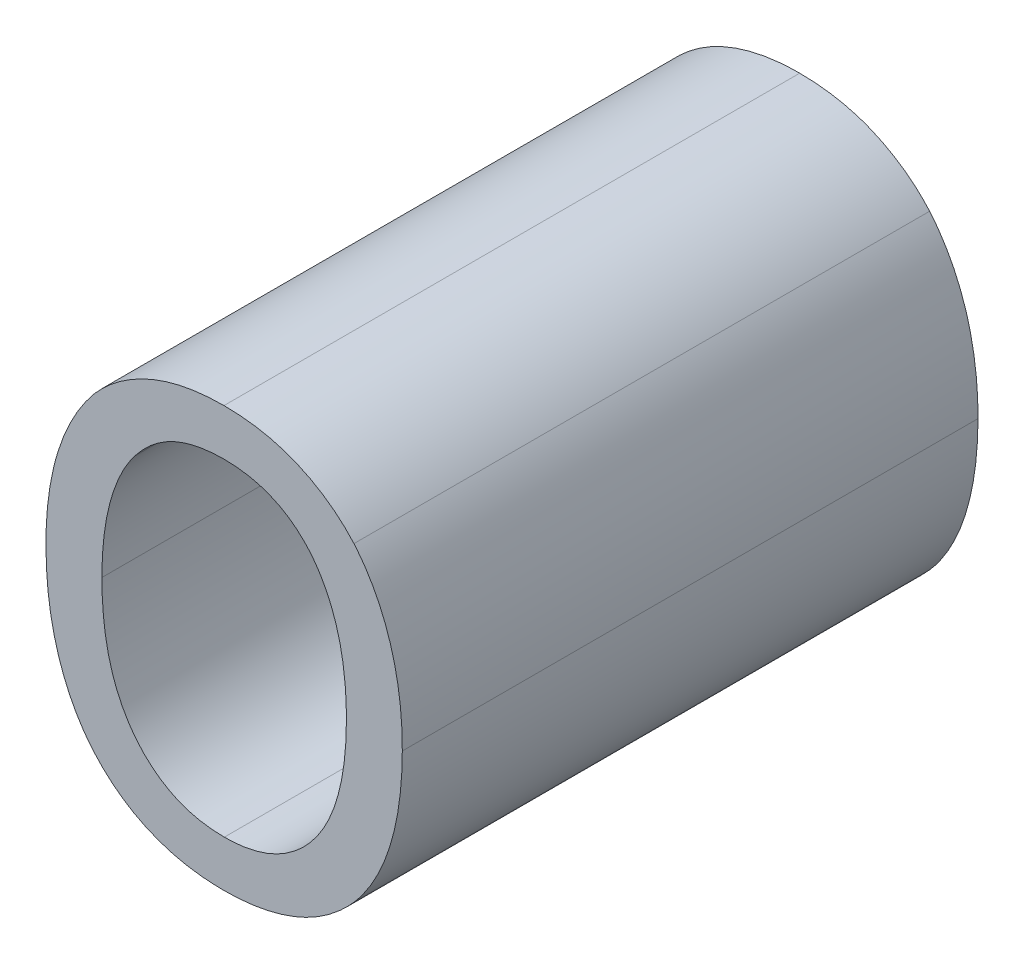
ISO-10303-21;
HEADER;
FILE_DESCRIPTION(('STEP AP214'),'2;1');
FILE_NAME('part.step','',(''),(''),'','','');
FILE_SCHEMA(('AUTOMOTIVE_DESIGN { 1 0 10303 214 1 1 1 1 }'));
ENDSEC;
DATA;
#1=APPLICATION_CONTEXT('core data for automotive mechanical design processes');
#2=APPLICATION_PROTOCOL_DEFINITION('international standard','automotive_design',2000,#1);
#3=PRODUCT_CONTEXT('',#1,'mechanical');
#4=PRODUCT('Part','Part','',(#3));
#5=PRODUCT_RELATED_PRODUCT_CATEGORY('part','',(#4));
#6=PRODUCT_DEFINITION_FORMATION('','',#4);
#7=PRODUCT_DEFINITION_CONTEXT('part definition',#1,'design');
#8=PRODUCT_DEFINITION('design','',#6,#7);
#9=PRODUCT_DEFINITION_SHAPE('','',#8);
#10=(LENGTH_UNIT() NAMED_UNIT(*) SI_UNIT(.MILLI.,.METRE.));
#11=(NAMED_UNIT(*) PLANE_ANGLE_UNIT() SI_UNIT($,.RADIAN.));
#12=(NAMED_UNIT(*) SI_UNIT($,.STERADIAN.) SOLID_ANGLE_UNIT());
#13=UNCERTAINTY_MEASURE_WITH_UNIT(LENGTH_MEASURE(1.E-05),#10,'distance_accuracy_value','');
#14=(GEOMETRIC_REPRESENTATION_CONTEXT(3) GLOBAL_UNCERTAINTY_ASSIGNED_CONTEXT((#13)) GLOBAL_UNIT_ASSIGNED_CONTEXT((#10,
#11,#12)) REPRESENTATION_CONTEXT('',''));
#15=CARTESIAN_POINT('',(0.,0.,0.));
#16=DIRECTION('',(0.,0.,1.));
#17=DIRECTION('',(1.,0.,0.));
#18=AXIS2_PLACEMENT_3D('',#15,#16,#17);
#19=CARTESIAN_POINT('',(0.422403275104176,-0.565334370552193,0.));
#20=CARTESIAN_POINT('',(0.422403275104176,-0.565334370552193,0.1));
#21=CARTESIAN_POINT('',(0.432103437478142,-0.565334370552193,0.));
#22=CARTESIAN_POINT('',(0.432103437478142,-0.565334370552193,0.1));
#23=CARTESIAN_POINT('',(0.443618834916242,-0.550699037847612,0.));
#24=CARTESIAN_POINT('',(0.443618834916242,-0.550699037847612,0.1));
#25=CARTESIAN_POINT('',(0.443618834916242,-0.536914596579344,0.));
#26=CARTESIAN_POINT('',(0.443618834916242,-0.536914596579344,0.1));
#27=B_SPLINE_SURFACE_WITH_KNOTS('',2,1,((#19,#20),(#21,#22),(#23,#24),(#25,#26)),.UNSPECIFIED.,
.F.,.F.,.F.,(3,1,3),(2,2),(0.,0.5,1.),(0.,1.),.UNSPECIFIED.);
#28=CARTESIAN_POINT('',(0.422403275104176,-0.565334370552193,0.));
#29=CARTESIAN_POINT('',(0.423495138457044,-0.565334263107982,0.));
#30=CARTESIAN_POINT('',(0.424590715243333,-0.565264151797034,0.));
#31=CARTESIAN_POINT('',(0.426759658611366,-0.564957067043967,0.));
#32=CARTESIAN_POINT('',(0.427832976390072,-0.564719760156023,0.));
#33=CARTESIAN_POINT('',(0.430637326541838,-0.563822783819439,0.));
#34=CARTESIAN_POINT('',(0.432316583185164,-0.562985304936494,0.));
#35=CARTESIAN_POINT('',(0.43537698398701,-0.560810381148516,0.));
#36=CARTESIAN_POINT('',(0.436747967024062,-0.559459023493926,0.));
#37=CARTESIAN_POINT('',(0.439229436705532,-0.556245914148621,0.));
#38=CARTESIAN_POINT('',(0.440281450420306,-0.5543402874569,0.));
#39=CARTESIAN_POINT('',(0.442097683101466,-0.549858351756391,0.));
#40=CARTESIAN_POINT('',(0.442726866479257,-0.547232566941976,0.));
#41=CARTESIAN_POINT('',(0.443467601855112,-0.542023477904733,0.));
#42=CARTESIAN_POINT('',(0.443601358169113,-0.539443657523063,0.));
#43=CARTESIAN_POINT('',(0.443618834916242,-0.536914596432091,0.));
#44=B_SPLINE_CURVE_WITH_KNOTS('',3,(#28,#29,#30,#31,#32,#33,#34,#35,#36,#37,#38,#39,#40,#41,#42,
#43),.UNSPECIFIED.,.F.,.F.,(4,2,2,2,2,2,2,4),(0.,0.00327846290659307,0.00656348277852888,
0.0120934053194897,0.0177851425822794,0.0242300112273422,0.0322649099058238,0.0399350119896171),.UNSPECIFIED.);
#45=CARTESIAN_POINT('',(0.422403275104176,-0.565334370552193,0.));
#46=VERTEX_POINT('',#45);
#47=CARTESIAN_POINT('',(0.443618834916242,-0.536914596579344,0.));
#48=VERTEX_POINT('',#47);
#49=EDGE_CURVE('E11',#46,#48,#44,.T.);
#50=DIRECTION('',(0.,0.,1.));
#51=VECTOR('',#50,1.);
#52=CARTESIAN_POINT('',(0.422403275104176,-0.565334370552193,0.));
#53=LINE('',#52,#51);
#54=CARTESIAN_POINT('',(0.422403275104176,-0.565334370552193,0.1));
#55=VERTEX_POINT('',#54);
#56=EDGE_CURVE('E319',#46,#55,#53,.T.);
#57=CARTESIAN_POINT('',(0.443618834916242,-0.536914596579344,0.1));
#58=CARTESIAN_POINT('',(0.443612031296942,-0.54079173974196,0.1));
#59=CARTESIAN_POINT('',(0.443279629406607,-0.544918162100005,0.1));
#60=CARTESIAN_POINT('',(0.441567296807279,-0.551406113980255,0.1));
#61=CARTESIAN_POINT('',(0.440578244383015,-0.553893690361702,0.1));
#62=CARTESIAN_POINT('',(0.438075855391576,-0.557905684085802,0.1));
#63=CARTESIAN_POINT('',(0.4367232359663,-0.559521923418348,0.1));
#64=CARTESIAN_POINT('',(0.433726522308547,-0.562091791110961,0.1));
#65=CARTESIAN_POINT('',(0.432127181825424,-0.563096741479701,0.1));
#66=CARTESIAN_POINT('',(0.428677919089497,-0.564551973429292,0.1));
#67=CARTESIAN_POINT('',(0.426825613979062,-0.564996510459382,0.1));
#68=CARTESIAN_POINT('',(0.424104545069922,-0.56529326478391,0.1));
#69=CARTESIAN_POINT('',(0.423251272825868,-0.56533639619699,0.1));
#70=CARTESIAN_POINT('',(0.422403272522582,-0.565334370552193,0.1));
#71=B_SPLINE_CURVE_WITH_KNOTS('',3,(#57,#58,#59,#60,#61,#62,#63,#64,#65,#66,#67,#68,#69,#70),
.UNSPECIFIED.,.F.,.F.,(4,2,2,2,2,2,4),(0.,0.0119835687455253,0.0199276332555216,
0.0261447212240271,0.0317172910651487,0.0373465303396994,0.0399005627300019),.UNSPECIFIED.);
#72=CARTESIAN_POINT('',(0.443618834916242,-0.536914596579344,0.1));
#73=VERTEX_POINT('',#72);
#74=EDGE_CURVE('E325',#73,#55,#71,.T.);
#75=DIRECTION('',(0.,0.,1.));
#76=VECTOR('',#75,1.);
#77=CARTESIAN_POINT('',(0.443618834916242,-0.536914596579344,0.));
#78=LINE('',#77,#76);
#79=EDGE_CURVE('E340',#48,#73,#78,.T.);
#80=ORIENTED_EDGE('',*,*,#49,.F.);
#81=ORIENTED_EDGE('',*,*,#56,.T.);
#82=ORIENTED_EDGE('',*,*,#74,.F.);
#83=ORIENTED_EDGE('',*,*,#79,.F.);
#84=EDGE_LOOP('',(#80,#81,#82,#83));
#85=FACE_BOUND('',#84,.T.);
#86=ADVANCED_FACE('F17',(#85),#27,.F.);
#87=CARTESIAN_POINT('',(0.401130989196355,-0.536914596579344,0.));
#88=CARTESIAN_POINT('',(0.401130989196355,-0.536914596579344,0.1));
#89=CARTESIAN_POINT('',(0.401130989196355,-0.550699037847612,0.));
#90=CARTESIAN_POINT('',(0.401130989196355,-0.550699037847612,0.1));
#91=CARTESIAN_POINT('',(0.412703112730209,-0.565334370552193,0.));
#92=CARTESIAN_POINT('',(0.412703112730209,-0.565334370552193,0.1));
#93=CARTESIAN_POINT('',(0.422403275104176,-0.565334370552193,0.));
#94=CARTESIAN_POINT('',(0.422403275104176,-0.565334370552193,0.1));
#95=B_SPLINE_SURFACE_WITH_KNOTS('',2,1,((#87,#88),(#89,#90),(#91,#92),(#93,#94)),.UNSPECIFIED.,
.F.,.F.,.F.,(3,1,3),(2,2),(0.,0.5,1.),(0.,1.),.UNSPECIFIED.);
#96=CARTESIAN_POINT('',(0.401130989196355,-0.536914596579344,0.));
#97=CARTESIAN_POINT('',(0.401136241934104,-0.540785127218079,0.));
#98=CARTESIAN_POINT('',(0.401470524293703,-0.544903733464903,0.));
#99=CARTESIAN_POINT('',(0.403184922398802,-0.551383233523398,0.));
#100=CARTESIAN_POINT('',(0.404175927829298,-0.553869767470615,0.));
#101=CARTESIAN_POINT('',(0.406683302419975,-0.557882444810912,0.));
#102=CARTESIAN_POINT('',(0.408040140921679,-0.55950004273732,0.));
#103=CARTESIAN_POINT('',(0.411048222164214,-0.562078897590311,0.));
#104=CARTESIAN_POINT('',(0.412656260396007,-0.563089727471742,0.));
#105=CARTESIAN_POINT('',(0.416121817826099,-0.564551333481528,0.));
#106=CARTESIAN_POINT('',(0.417981310997891,-0.564997355105394,0.));
#107=CARTESIAN_POINT('',(0.420707036765639,-0.565293517204085,0.));
#108=CARTESIAN_POINT('',(0.421557758650891,-0.565336401203627,0.));
#109=CARTESIAN_POINT('',(0.42240327765669,-0.565334370552193,0.));
#110=B_SPLINE_CURVE_WITH_KNOTS('',3,(#96,#97,#98,#99,#100,#101,#102,#103,#104,#105,#106,#107,
#108,#109),.UNSPECIFIED.,.F.,.F.,(4,2,2,2,2,2,4),(0.,0.0119617055059878,0.0199045495341607,
0.0261332744891407,0.031736974221413,0.0373875384496303,0.0399340164870983),.UNSPECIFIED.);
#111=CARTESIAN_POINT('',(0.401130989196355,-0.536914596579344,0.));
#112=VERTEX_POINT('',#111);
#113=EDGE_CURVE('E32',#112,#46,#110,.T.);
#114=DIRECTION('',(0.,0.,1.));
#115=VECTOR('',#114,1.);
#116=CARTESIAN_POINT('',(0.401130989196355,-0.536914596579344,0.));
#117=LINE('',#116,#115);
#118=CARTESIAN_POINT('',(0.401130989196355,-0.536914596579344,0.1));
#119=VERTEX_POINT('',#118);
#120=EDGE_CURVE('E322',#112,#119,#117,.T.);
#121=CARTESIAN_POINT('',(0.422403275104176,-0.565334370552193,0.1));
#122=CARTESIAN_POINT('',(0.421309075220846,-0.565334280650465,0.1));
#123=CARTESIAN_POINT('',(0.420211154492617,-0.565263846528418,0.1));
#124=CARTESIAN_POINT('',(0.418037826487701,-0.564955665739269,0.1));
#125=CARTESIAN_POINT('',(0.416962463534833,-0.56471761660866,0.1));
#126=CARTESIAN_POINT('',(0.414149121808028,-0.563817179758932,0.1));
#127=CARTESIAN_POINT('',(0.412463435151057,-0.562975626676238,0.1));
#128=CARTESIAN_POINT('',(0.409387351404414,-0.560789951499222,0.1));
#129=CARTESIAN_POINT('',(0.408007798204483,-0.559430979759868,0.1));
#130=CARTESIAN_POINT('',(0.405516949016988,-0.556205329726687,0.1));
#131=CARTESIAN_POINT('',(0.404462527146574,-0.554295947226072,0.1));
#132=CARTESIAN_POINT('',(0.402644185222629,-0.549806229594325,0.1));
#133=CARTESIAN_POINT('',(0.402015454601813,-0.547176360654875,0.1));
#134=CARTESIAN_POINT('',(0.401280621076095,-0.541983177571889,0.1));
#135=CARTESIAN_POINT('',(0.40114803606537,-0.539423983049477,0.1));
#136=CARTESIAN_POINT('',(0.401130989196355,-0.536914596131235,0.1));
#137=B_SPLINE_CURVE_WITH_KNOTS('',3,(#121,#122,#123,#124,#125,#126,#127,#128,#129,#130,#131,
#132,#133,#134,#135,#136),.UNSPECIFIED.,.F.,.F.,(4,2,2,2,2,2,2,4),(0.,0.00328547995459584,
0.00657690384601922,0.0121294196598876,0.0178550344786013,0.024312925223907,0.0323587914208523,
0.0399685244388434),.UNSPECIFIED.);
#138=EDGE_CURVE('E336',#55,#119,#137,.T.);
#139=ORIENTED_EDGE('',*,*,#113,.F.);
#140=ORIENTED_EDGE('',*,*,#120,.T.);
#141=ORIENTED_EDGE('',*,*,#138,.F.);
#142=ORIENTED_EDGE('',*,*,#56,.F.);
#143=EDGE_LOOP('',(#139,#140,#141,#142));
#144=FACE_BOUND('',#143,.T.);
#145=ADVANCED_FACE('F209',(#144),#95,.F.);
#146=CARTESIAN_POINT('',(0.406860324867528,-0.515755762863032,0.));
#147=CARTESIAN_POINT('',(0.406860324867528,-0.515755762863032,0.1));
#148=CARTESIAN_POINT('',(0.404080746175573,-0.519329506895546,0.));
#149=CARTESIAN_POINT('',(0.404080746175573,-0.519329506895546,0.1));
#150=CARTESIAN_POINT('',(0.401130989196355,-0.530107465088842,0.));
#151=CARTESIAN_POINT('',(0.401130989196355,-0.530107465088842,0.1));
#152=CARTESIAN_POINT('',(0.401130989196355,-0.536914596579344,0.));
#153=CARTESIAN_POINT('',(0.401130989196355,-0.536914596579344,0.1));
#154=B_SPLINE_SURFACE_WITH_KNOTS('',2,1,((#146,#147),(#148,#149),(#150,#151),(#152,#153)),
.UNSPECIFIED.,.F.,.F.,.F.,(3,1,3),(2,2),(0.,0.5,1.),(0.,1.),.UNSPECIFIED.);
#155=CARTESIAN_POINT('',(0.406860324867528,-0.515755762863032,0.));
#156=CARTESIAN_POINT('',(0.405657397335435,-0.517343188494508,0.));
#157=CARTESIAN_POINT('',(0.40469318068862,-0.519060110368438,0.));
#158=CARTESIAN_POINT('',(0.402837976651734,-0.523410798796499,0.));
#159=CARTESIAN_POINT('',(0.402142700160432,-0.526129789551262,0.));
#160=CARTESIAN_POINT('',(0.401306736121386,-0.531562905988082,0.));
#161=CARTESIAN_POINT('',(0.401147723861368,-0.534273956397874,0.));
#162=CARTESIAN_POINT('',(0.401130989196355,-0.536914599776286,0.));
#163=B_SPLINE_CURVE_WITH_KNOTS('',3,(#155,#156,#157,#158,#159,#160,#161,#162),.UNSPECIFIED.,.F.,
.F.,(4,2,2,4),(0.,0.00589018398543234,0.014219790021341,0.0222617131194405),.UNSPECIFIED.);
#164=CARTESIAN_POINT('',(0.406860324867528,-0.515755762863032,0.));
#165=VERTEX_POINT('',#164);
#166=EDGE_CURVE('E308',#165,#112,#163,.T.);
#167=DIRECTION('',(0.,0.,1.));
#168=VECTOR('',#167,1.);
#169=CARTESIAN_POINT('',(0.406860324867528,-0.515755762863032,0.));
#170=LINE('',#169,#168);
#171=CARTESIAN_POINT('',(0.406860324867528,-0.515755762863032,0.1));
#172=VERTEX_POINT('',#171);
#173=EDGE_CURVE('E334',#165,#172,#170,.T.);
#174=CARTESIAN_POINT('',(0.401130989196355,-0.536914596579344,0.1));
#175=CARTESIAN_POINT('',(0.401133799328813,-0.534884316236864,0.1));
#176=CARTESIAN_POINT('',(0.40122926046152,-0.532850992452005,0.1));
#177=CARTESIAN_POINT('',(0.401688291751139,-0.528772010387163,0.1));
#178=CARTESIAN_POINT('',(0.402057633057826,-0.526727041384421,0.1));
#179=CARTESIAN_POINT('',(0.403288166939586,-0.522218760920778,0.1));
#180=CARTESIAN_POINT('',(0.404247549902667,-0.519775436044707,0.1));
#181=CARTESIAN_POINT('',(0.405987204330638,-0.516948613481366,0.1));
#182=CARTESIAN_POINT('',(0.406406313305087,-0.516339946628976,0.1));
#183=CARTESIAN_POINT('',(0.406860324867528,-0.515755762863032,0.1));
#184=B_SPLINE_CURVE_WITH_KNOTS('',3,(#174,#175,#176,#177,#178,#179,#180,#181,#182,#183),
.UNSPECIFIED.,.F.,.F.,(4,2,2,2,4),(0.,0.00608990690111218,0.0123119217698571,0.0200554605451938,
0.0222703824689008),.UNSPECIFIED.);
#185=EDGE_CURVE('E352',#119,#172,#184,.T.);
#186=ORIENTED_EDGE('',*,*,#166,.F.);
#187=ORIENTED_EDGE('',*,*,#173,.T.);
#188=ORIENTED_EDGE('',*,*,#185,.F.);
#189=ORIENTED_EDGE('',*,*,#120,.F.);
#190=EDGE_LOOP('',(#186,#187,#188,#189));
#191=FACE_BOUND('',#190,.T.);
#192=ADVANCED_FACE('F205',(#191),#154,.F.);
#193=CARTESIAN_POINT('',(0.422403275104176,-0.508494822606496,0.));
#194=CARTESIAN_POINT('',(0.422403275104176,-0.508494822606496,0.1));
#195=CARTESIAN_POINT('',(0.417354652582053,-0.508494822606496,0.));
#196=CARTESIAN_POINT('',(0.417354652582053,-0.508494822606496,0.1));
#197=CARTESIAN_POINT('',(0.409753355750992,-0.512011840543256,0.));
#198=CARTESIAN_POINT('',(0.409753355750992,-0.512011840543256,0.1));
#199=CARTESIAN_POINT('',(0.406860324867528,-0.515755762863032,0.));
#200=CARTESIAN_POINT('',(0.406860324867528,-0.515755762863032,0.1));
#201=B_SPLINE_SURFACE_WITH_KNOTS('',2,1,((#193,#194),(#195,#196),(#197,#198),(#199,#200)),
.UNSPECIFIED.,.F.,.F.,.F.,(3,1,3),(2,2),(0.,0.5,1.),(0.,1.),.UNSPECIFIED.);
#202=CARTESIAN_POINT('',(0.422403275104176,-0.508494822606496,0.));
#203=CARTESIAN_POINT('',(0.421300453813318,-0.508494125766198,0.));
#204=CARTESIAN_POINT('',(0.420191502778547,-0.508557579077204,0.));
#205=CARTESIAN_POINT('',(0.417993518156848,-0.508844335852738,0.));
#206=CARTESIAN_POINT('',(0.416904519609753,-0.509067897179064,0.));
#207=CARTESIAN_POINT('',(0.415032527364356,-0.509631339319363,0.));
#208=CARTESIAN_POINT('',(0.414237914597769,-0.509931375759785,0.));
#209=CARTESIAN_POINT('',(0.41270672773958,-0.51065143038063,0.));
#210=CARTESIAN_POINT('',(0.411970028668521,-0.51107118061213,0.));
#211=CARTESIAN_POINT('',(0.410427823343848,-0.512113748382064,0.));
#212=CARTESIAN_POINT('',(0.40963867187544,-0.512760485981555,0.));
#213=CARTESIAN_POINT('',(0.408166099117643,-0.514176197228732,0.));
#214=CARTESIAN_POINT('',(0.407483538723554,-0.514946073733799,0.));
#215=CARTESIAN_POINT('',(0.406860324215222,-0.515755763707193,0.));
#216=B_SPLINE_CURVE_WITH_KNOTS('',3,(#202,#203,#204,#205,#206,#207,#208,#209,#210,#211,#212,
#213,#214,#215),.UNSPECIFIED.,.F.,.F.,(4,2,2,2,2,2,4),(0.,0.00331628387168298,
0.00663792082681027,0.00917652757676522,0.0117094963019628,0.0147562616431061,
0.0178264866671859),.UNSPECIFIED.);
#217=CARTESIAN_POINT('',(0.422403275104176,-0.508494822606496,0.));
#218=VERTEX_POINT('',#217);
#219=EDGE_CURVE('E300',#218,#165,#216,.T.);
#220=DIRECTION('',(0.,0.,1.));
#221=VECTOR('',#220,1.);
#222=CARTESIAN_POINT('',(0.422403275104176,-0.508494822606496,0.));
#223=LINE('',#222,#221);
#224=CARTESIAN_POINT('',(0.422403275104176,-0.508494822606496,0.1));
#225=VERTEX_POINT('',#224);
#226=EDGE_CURVE('E350',#218,#225,#223,.T.);
#227=CARTESIAN_POINT('',(0.406860324867528,-0.515755762863032,0.1));
#228=CARTESIAN_POINT('',(0.407459671786939,-0.514977469977176,0.1));
#229=CARTESIAN_POINT('',(0.408113359846047,-0.514236081261466,0.1));
#230=CARTESIAN_POINT('',(0.409520624565216,-0.512866050952403,0.1));
#231=CARTESIAN_POINT('',(0.410273513565939,-0.512236697598913,0.1));
#232=CARTESIAN_POINT('',(0.411762219669041,-0.511199459827289,0.1));
#233=CARTESIAN_POINT('',(0.412484723938984,-0.510772702581416,0.1));
#234=CARTESIAN_POINT('',(0.413988608098148,-0.510036085517271,0.1));
#235=CARTESIAN_POINT('',(0.414770108727842,-0.509726473677614,0.1));
#236=CARTESIAN_POINT('',(0.416669798307297,-0.509121991480205,0.1));
#237=CARTESIAN_POINT('',(0.417803432495361,-0.508877087486116,0.1));
#238=CARTESIAN_POINT('',(0.420094967342109,-0.508563096043584,0.1));
#239=CARTESIAN_POINT('',(0.421252849390878,-0.508493878408972,0.1));
#240=CARTESIAN_POINT('',(0.422403278342035,-0.508494822606496,0.1));
#241=B_SPLINE_CURVE_WITH_KNOTS('',3,(#227,#228,#229,#230,#231,#232,#233,#234,#235,#236,#237,
#238,#239,#240),.UNSPECIFIED.,.F.,.F.,(4,2,2,2,2,2,4),(0.,0.0029509931779533,
0.00588251197857523,0.00838956159719114,0.0109018889472316,0.0143654450247536,
0.0178264338061303),.UNSPECIFIED.);
#242=EDGE_CURVE('E363',#172,#225,#241,.T.);
#243=ORIENTED_EDGE('',*,*,#219,.F.);
#244=ORIENTED_EDGE('',*,*,#226,.T.);
#245=ORIENTED_EDGE('',*,*,#242,.F.);
#246=ORIENTED_EDGE('',*,*,#173,.F.);
#247=EDGE_LOOP('',(#243,#244,#245,#246));
#248=FACE_BOUND('',#247,.T.);
#249=ADVANCED_FACE('F370',(#248),#201,.F.);
#250=CARTESIAN_POINT('',(0.437889499245069,-0.515755762863032,0.));
#251=CARTESIAN_POINT('',(0.437889499245069,-0.515755762863032,0.1));
#252=CARTESIAN_POINT('',(0.435109920553114,-0.512125292734764,0.));
#253=CARTESIAN_POINT('',(0.435109920553114,-0.512125292734764,0.1));
#254=CARTESIAN_POINT('',(0.427281719339036,-0.508494822606496,0.));
#255=CARTESIAN_POINT('',(0.427281719339036,-0.508494822606496,0.1));
#256=CARTESIAN_POINT('',(0.422403275104176,-0.508494822606496,0.));
#257=CARTESIAN_POINT('',(0.422403275104176,-0.508494822606496,0.1));
#258=B_SPLINE_SURFACE_WITH_KNOTS('',2,1,((#250,#251),(#252,#253),(#254,#255),(#256,#257)),
.UNSPECIFIED.,.F.,.F.,.F.,(3,1,3),(2,2),(0.,0.5,1.),(0.,1.),.UNSPECIFIED.);
#259=CARTESIAN_POINT('',(0.437889499245069,-0.515755762863032,0.));
#260=CARTESIAN_POINT('',(0.437309438402187,-0.514996323780321,0.));
#261=CARTESIAN_POINT('',(0.436674437035518,-0.514277273284337,0.));
#262=CARTESIAN_POINT('',(0.435305465842282,-0.512950390543772,0.));
#263=CARTESIAN_POINT('',(0.434572137557362,-0.512341893009954,0.));
#264=CARTESIAN_POINT('',(0.432352197083969,-0.510799342294575,0.));
#265=CARTESIAN_POINT('',(0.43075133372932,-0.51002273452031,0.));
#266=CARTESIAN_POINT('',(0.428004313107924,-0.509137128183772,0.));
#267=CARTESIAN_POINT('',(0.42689776427983,-0.50888912418037,0.));
#268=CARTESIAN_POINT('',(0.424661024830168,-0.508567753400762,0.));
#269=CARTESIAN_POINT('',(0.423530884027806,-0.508494050070703,0.));
#270=CARTESIAN_POINT('',(0.42240327458025,-0.508494822606496,0.));
#271=B_SPLINE_CURVE_WITH_KNOTS('',3,(#259,#260,#261,#262,#263,#264,#265,#266,#267,#268,#269,
#270),.UNSPECIFIED.,.F.,.F.,(4,2,2,2,2,4),(0.,0.00286586350035589,0.00571386404001678,
0.01096053436187,0.0143501879972104,0.0177332912518968),.UNSPECIFIED.);
#272=CARTESIAN_POINT('',(0.437889499245069,-0.515755762863032,0.));
#273=VERTEX_POINT('',#272);
#274=EDGE_CURVE('E291',#273,#218,#271,.T.);
#275=DIRECTION('',(0.,0.,1.));
#276=VECTOR('',#275,1.);
#277=CARTESIAN_POINT('',(0.437889499245069,-0.515755762863032,0.));
#278=LINE('',#277,#276);
#279=CARTESIAN_POINT('',(0.437889499245069,-0.515755762863032,0.1));
#280=VERTEX_POINT('',#279);
#281=EDGE_CURVE('E362',#273,#280,#278,.T.);
#282=CARTESIAN_POINT('',(0.422403275104176,-0.508494822606496,0.1));
#283=CARTESIAN_POINT('',(0.423506929251667,-0.508494371114695,0.1));
#284=CARTESIAN_POINT('',(0.424612619654994,-0.508564769394667,0.1));
#285=CARTESIAN_POINT('',(0.426802676934392,-0.508871736015724,0.1));
#286=CARTESIAN_POINT('',(0.427886986270143,-0.509108702728819,0.1));
#287=CARTESIAN_POINT('',(0.430671777095638,-0.509983496206457,0.1));
#288=CARTESIAN_POINT('',(0.43232879584073,-0.510779987335825,0.1));
#289=CARTESIAN_POINT('',(0.434589267004601,-0.512355495324966,0.1));
#290=CARTESIAN_POINT('',(0.435318569042352,-0.512962071332491,0.1));
#291=CARTESIAN_POINT('',(0.436680239427701,-0.514283939737924,0.1));
#292=CARTESIAN_POINT('',(0.437311986428375,-0.514999875523894,0.1));
#293=CARTESIAN_POINT('',(0.437889499278994,-0.515755762907342,0.1));
#294=B_SPLINE_CURVE_WITH_KNOTS('',3,(#282,#283,#284,#285,#286,#287,#288,#289,#290,#291,#292,
#293),.UNSPECIFIED.,.F.,.F.,(4,2,2,2,2,4),(0.,0.00331059657843944,0.00662913797694552,
0.012044048621758,0.0148793222088958,0.017731969019986),.UNSPECIFIED.);
#295=EDGE_CURVE('E639',#225,#280,#294,.T.);
#296=ORIENTED_EDGE('',*,*,#274,.F.);
#297=ORIENTED_EDGE('',*,*,#281,.T.);
#298=ORIENTED_EDGE('',*,*,#295,.F.);
#299=ORIENTED_EDGE('',*,*,#226,.F.);
#300=EDGE_LOOP('',(#296,#297,#298,#299));
#301=FACE_BOUND('',#300,.T.);
#302=ADVANCED_FACE('F375',(#301),#258,.F.);
#303=CARTESIAN_POINT('',(0.443618834916242,-0.536914596579344,0.));
#304=CARTESIAN_POINT('',(0.443618834916242,-0.536914596579344,0.1));
#305=CARTESIAN_POINT('',(0.443618834916242,-0.529994012897334,0.));
#306=CARTESIAN_POINT('',(0.443618834916242,-0.529994012897334,0.1));
#307=CARTESIAN_POINT('',(0.44061235184127,-0.519272780799792,0.));
#308=CARTESIAN_POINT('',(0.44061235184127,-0.519272780799792,0.1));
#309=CARTESIAN_POINT('',(0.437889499245069,-0.515755762863032,0.));
#310=CARTESIAN_POINT('',(0.437889499245069,-0.515755762863032,0.1));
#311=B_SPLINE_SURFACE_WITH_KNOTS('',2,1,((#303,#304),(#305,#306),(#307,#308),(#309,#310)),
.UNSPECIFIED.,.F.,.F.,.F.,(3,1,3),(2,2),(0.,0.5,1.),(0.,1.),.UNSPECIFIED.);
#312=CARTESIAN_POINT('',(0.443618834916242,-0.536914596579344,0.));
#313=CARTESIAN_POINT('',(0.443619302461356,-0.534925601213001,0.));
#314=CARTESIAN_POINT('',(0.443527832583521,-0.532934234743709,0.));
#315=CARTESIAN_POINT('',(0.443086995570201,-0.528941711974556,0.));
#316=CARTESIAN_POINT('',(0.442732526090879,-0.526941151211069,0.));
#317=CARTESIAN_POINT('',(0.441538996925787,-0.522455036419514,0.));
#318=CARTESIAN_POINT('',(0.440591830136626,-0.519991001133212,0.));
#319=CARTESIAN_POINT('',(0.438839233059685,-0.517069647790521,0.));
#320=CARTESIAN_POINT('',(0.438384958208045,-0.51639844312515,0.));
#321=CARTESIAN_POINT('',(0.437889499245069,-0.515755762863032,0.));
#322=B_SPLINE_CURVE_WITH_KNOTS('',3,(#312,#313,#314,#315,#316,#317,#318,#319,#320,#321),
.UNSPECIFIED.,.F.,.F.,(4,2,2,2,4),(0.,0.00596495310252562,0.0120487591867507,0.0198405488048869,
0.0222693443160283),.UNSPECIFIED.);
#323=EDGE_CURVE('E281',#48,#273,#322,.T.);
#324=CARTESIAN_POINT('',(0.437889499910816,-0.515755763722956,0.1));
#325=CARTESIAN_POINT('',(0.439061870241123,-0.51731655358336,0.1));
#326=CARTESIAN_POINT('',(0.440010103698864,-0.519000477638522,0.1));
#327=CARTESIAN_POINT('',(0.44183523303496,-0.523230889879549,0.1));
#328=CARTESIAN_POINT('',(0.44253550077574,-0.525855070217112,0.1));
#329=CARTESIAN_POINT('',(0.443434165475869,-0.531313209850699,0.1));
#330=CARTESIAN_POINT('',(0.443609834776302,-0.53415134152759,0.1));
#331=CARTESIAN_POINT('',(0.443618834916242,-0.536914596579344,0.1));
#332=B_SPLINE_CURVE_WITH_KNOTS('',3,(#324,#325,#326,#327,#328,#329,#330,#331),.UNSPECIFIED.,.F.,
.F.,(4,2,2,4),(0.,0.00578056075423867,0.0138479751007666,0.0222601694424388),.UNSPECIFIED.);
#333=EDGE_CURVE('E631',#280,#73,#332,.T.);
#334=ORIENTED_EDGE('',*,*,#323,.F.);
#335=ORIENTED_EDGE('',*,*,#79,.T.);
#336=ORIENTED_EDGE('',*,*,#333,.F.);
#337=ORIENTED_EDGE('',*,*,#281,.F.);
#338=EDGE_LOOP('',(#334,#335,#336,#337));
#339=FACE_BOUND('',#338,.T.);
#340=ADVANCED_FACE('F387',(#339),#311,.F.);
#341=CARTESIAN_POINT('',(0.444923535118588,-0.563859492062584,0.));
#342=CARTESIAN_POINT('',(0.444923535118588,-0.563859492062584,0.1));
#343=CARTESIAN_POINT('',(0.44900781401289,-0.55920795221074,0.));
#344=CARTESIAN_POINT('',(0.44900781401289,-0.55920795221074,0.1));
#345=CARTESIAN_POINT('',(0.453318997290208,-0.545423510942473,0.));
#346=CARTESIAN_POINT('',(0.453318997290208,-0.545423510942473,0.1));
#347=CARTESIAN_POINT('',(0.453318997290208,-0.536914596579344,0.));
#348=CARTESIAN_POINT('',(0.453318997290208,-0.536914596579344,0.1));
#349=B_SPLINE_SURFACE_WITH_KNOTS('',2,1,((#341,#342),(#343,#344),(#345,#346),(#347,#348)),
.UNSPECIFIED.,.F.,.F.,.F.,(3,1,3),(2,2),(0.,0.5,1.),(0.,1.),.UNSPECIFIED.);
#350=CARTESIAN_POINT('',(0.453318997290208,-0.536914596579344,0.));
#351=CARTESIAN_POINT('',(0.453319377126097,-0.541759116328101,0.));
#352=CARTESIAN_POINT('',(0.452766654998256,-0.54689435369178,0.));
#353=CARTESIAN_POINT('',(0.450382857559368,-0.554984717923288,0.));
#354=CARTESIAN_POINT('',(0.449026036563842,-0.558105682325099,0.));
#355=CARTESIAN_POINT('',(0.446493366795907,-0.561936645027127,0.));
#356=CARTESIAN_POINT('',(0.445744416851001,-0.5629244590235,0.));
#357=CARTESIAN_POINT('',(0.444923535118588,-0.563859492062584,0.));
#358=B_SPLINE_CURVE_WITH_KNOTS('',3,(#350,#351,#352,#353,#354,#355,#356,#357),.UNSPECIFIED.,.F.,
.F.,(4,2,2,4),(0.,0.0149417427834172,0.0250236945272247,0.0287382814460734),.UNSPECIFIED.);
#359=CARTESIAN_POINT('',(0.453318997290208,-0.536914596579344,0.));
#360=VERTEX_POINT('',#359);
#361=CARTESIAN_POINT('',(0.444923535118588,-0.563859492062584,0.));
#362=VERTEX_POINT('',#361);
#363=EDGE_CURVE('E272',#360,#362,#358,.T.);
#364=DIRECTION('',(0.,0.,1.));
#365=VECTOR('',#364,1.);
#366=CARTESIAN_POINT('',(0.453318997290208,-0.536914596579344,0.));
#367=LINE('',#366,#365);
#368=CARTESIAN_POINT('',(0.453318997290208,-0.536914596579344,0.1));
#369=VERTEX_POINT('',#368);
#370=EDGE_CURVE('E633',#360,#369,#367,.T.);
#371=CARTESIAN_POINT('',(0.444923535118588,-0.563859492062584,0.1));
#372=CARTESIAN_POINT('',(0.446733519556315,-0.561773134216273,0.1));
#373=CARTESIAN_POINT('',(0.448191069417562,-0.559463949940256,0.1));
#374=CARTESIAN_POINT('',(0.450876486294953,-0.553782620340378,0.1));
#375=CARTESIAN_POINT('',(0.451886761792927,-0.550304981888601,0.1));
#376=CARTESIAN_POINT('',(0.453075952558193,-0.543489544655986,0.1));
#377=CARTESIAN_POINT('',(0.453314628920135,-0.540162640926936,0.1));
#378=CARTESIAN_POINT('',(0.453318997290208,-0.536914596579344,0.1));
#379=B_SPLINE_CURVE_WITH_KNOTS('',3,(#371,#372,#373,#374,#375,#376,#377,#378),.UNSPECIFIED.,.F.,
.F.,(4,2,2,4),(0.,0.0081554324233815,0.0188841996620323,0.0287591796295877),.UNSPECIFIED.);
#380=CARTESIAN_POINT('',(0.444923535118588,-0.563859492062584,0.1));
#381=VERTEX_POINT('',#380);
#382=EDGE_CURVE('E148',#381,#369,#379,.T.);
#383=DIRECTION('',(0.,0.,1.));
#384=VECTOR('',#383,1.);
#385=CARTESIAN_POINT('',(0.444923535118588,-0.563859492062584,0.));
#386=LINE('',#385,#384);
#387=EDGE_CURVE('E628',#362,#381,#386,.T.);
#388=ORIENTED_EDGE('',*,*,#363,.F.);
#389=ORIENTED_EDGE('',*,*,#370,.T.);
#390=ORIENTED_EDGE('',*,*,#382,.F.);
#391=ORIENTED_EDGE('',*,*,#387,.F.);
#392=EDGE_LOOP('',(#388,#389,#390,#391));
#393=FACE_BOUND('',#392,.T.);
#394=ADVANCED_FACE('F425',(#393),#349,.T.);
#395=CARTESIAN_POINT('',(0.422346549008422,-0.573389476149288,0.));
#396=CARTESIAN_POINT('',(0.422346549008422,-0.573389476149288,0.1));
#397=CARTESIAN_POINT('',(0.429210406594678,-0.573389476149288,0.));
#398=CARTESIAN_POINT('',(0.429210406594678,-0.573389476149288,0.1));
#399=CARTESIAN_POINT('',(0.44061235184127,-0.568737936297444,0.));
#400=CARTESIAN_POINT('',(0.44061235184127,-0.568737936297444,0.1));
#401=CARTESIAN_POINT('',(0.444923535118588,-0.563859492062584,0.));
#402=CARTESIAN_POINT('',(0.444923535118588,-0.563859492062584,0.1));
#403=B_SPLINE_SURFACE_WITH_KNOTS('',2,1,((#395,#396),(#397,#398),(#399,#400),(#401,#402)),
.UNSPECIFIED.,.F.,.F.,.F.,(3,1,3),(2,2),(0.,0.5,1.),(0.,1.),.UNSPECIFIED.);
#404=CARTESIAN_POINT('',(0.444923535118588,-0.563859492062584,0.));
#405=CARTESIAN_POINT('',(0.443979647850496,-0.564930703959633,0.));
#406=CARTESIAN_POINT('',(0.442955532951998,-0.565936857241807,0.));
#407=CARTESIAN_POINT('',(0.440773028247587,-0.567771198652658,0.));
#408=CARTESIAN_POINT('',(0.43961574850832,-0.568600714143578,0.));
#409=CARTESIAN_POINT('',(0.436133970793655,-0.570673245856667,0.));
#410=CARTESIAN_POINT('',(0.433658581672484,-0.571662072570593,0.));
#411=CARTESIAN_POINT('',(0.428231934333968,-0.573068915307128,0.));
#412=CARTESIAN_POINT('',(0.42525879731928,-0.573407304802974,0.));
#413=CARTESIAN_POINT('',(0.422346547180717,-0.573389476149288,0.));
#414=B_SPLINE_CURVE_WITH_KNOTS('',3,(#404,#405,#406,#407,#408,#409,#410,#411,#412,#413),
.UNSPECIFIED.,.F.,.F.,(4,2,2,2,4),(0.,0.0042864880371566,0.00853952962219771,0.016434569833852,
0.0252464885748008),.UNSPECIFIED.);
#415=CARTESIAN_POINT('',(0.422346549008422,-0.573389476149288,0.));
#416=VERTEX_POINT('',#415);
#417=EDGE_CURVE('E263',#362,#416,#414,.T.);
#418=CARTESIAN_POINT('',(0.422346549008422,-0.573389476149288,0.1));
#419=CARTESIAN_POINT('',(0.424074645698756,-0.573394117914761,0.1));
#420=CARTESIAN_POINT('',(0.425808362723922,-0.573280082106338,0.1));
#421=CARTESIAN_POINT('',(0.429245133822292,-0.572790439937054,0.1));
#422=CARTESIAN_POINT('',(0.430948028397471,-0.572413736237487,0.1));
#423=CARTESIAN_POINT('',(0.433917270564457,-0.571483347283172,0.1));
#424=CARTESIAN_POINT('',(0.43520015344063,-0.570983491187605,0.1));
#425=CARTESIAN_POINT('',(0.437666882087705,-0.569787009801194,0.1));
#426=CARTESIAN_POINT('',(0.438851041564834,-0.569091041179727,0.1));
#427=CARTESIAN_POINT('',(0.440882226039323,-0.567671274593099,0.1));
#428=CARTESIAN_POINT('',(0.441750673036085,-0.566977589316842,0.1));
#429=CARTESIAN_POINT('',(0.443403162110922,-0.565489424967366,0.1));
#430=CARTESIAN_POINT('',(0.444186845051399,-0.564694545881521,0.1));
#431=CARTESIAN_POINT('',(0.444923535836414,-0.563859491250307,0.1));
#432=B_SPLINE_CURVE_WITH_KNOTS('',3,(#418,#419,#420,#421,#422,#423,#424,#425,#426,#427,#428,
#429,#430,#431),.UNSPECIFIED.,.F.,.F.,(4,2,2,2,2,2,4),(0.,0.00518866537633728,
0.0103991381585853,0.0145146283545649,0.0186164986050824,0.0219432246937128,0.025283535060455),.UNSPECIFIED.);
#433=CARTESIAN_POINT('',(0.422346549008422,-0.573389476149288,0.1));
#434=VERTEX_POINT('',#433);
#435=EDGE_CURVE('E596',#434,#381,#432,.T.);
#436=DIRECTION('',(0.,0.,1.));
#437=VECTOR('',#436,1.);
#438=CARTESIAN_POINT('',(0.422346549008422,-0.573389476149288,0.));
#439=LINE('',#438,#437);
#440=EDGE_CURVE('E597',#416,#434,#439,.T.);
#441=ORIENTED_EDGE('',*,*,#417,.F.);
#442=ORIENTED_EDGE('',*,*,#387,.T.);
#443=ORIENTED_EDGE('',*,*,#435,.F.);
#444=ORIENTED_EDGE('',*,*,#440,.F.);
#445=EDGE_LOOP('',(#441,#442,#443,#444));
#446=FACE_BOUND('',#445,.T.);
#447=ADVANCED_FACE('F434',(#446),#403,.T.);
#448=CARTESIAN_POINT('',(0.399769562898255,-0.563859492062584,0.));
#449=CARTESIAN_POINT('',(0.399769562898255,-0.563859492062584,0.1));
#450=CARTESIAN_POINT('',(0.40391056788831,-0.568567758010182,0.));
#451=CARTESIAN_POINT('',(0.40391056788831,-0.568567758010182,0.1));
#452=CARTESIAN_POINT('',(0.415255787039148,-0.573389476149288,0.));
#453=CARTESIAN_POINT('',(0.415255787039148,-0.573389476149288,0.1));
#454=CARTESIAN_POINT('',(0.422346549008422,-0.573389476149288,0.));
#455=CARTESIAN_POINT('',(0.422346549008422,-0.573389476149288,0.1));
#456=B_SPLINE_SURFACE_WITH_KNOTS('',2,1,((#448,#449),(#450,#451),(#452,#453),(#454,#455)),
.UNSPECIFIED.,.F.,.F.,.F.,(3,1,3),(2,2),(0.,0.5,1.),(0.,1.),.UNSPECIFIED.);
#457=CARTESIAN_POINT('',(0.422346549008422,-0.573389476149288,0.));
#458=CARTESIAN_POINT('',(0.4206488106466,-0.573388542772347,0.));
#459=CARTESIAN_POINT('',(0.418944682095406,-0.57328464626476,0.));
#460=CARTESIAN_POINT('',(0.415566545979323,-0.572823870443045,0.));
#461=CARTESIAN_POINT('',(0.413892657164917,-0.572466152582958,0.));
#462=CARTESIAN_POINT('',(0.409609435250187,-0.571132305215097,0.));
#463=CARTESIAN_POINT('',(0.407069841235336,-0.569909323790423,0.));
#464=CARTESIAN_POINT('',(0.402923503534712,-0.56706418566721,0.));
#465=CARTESIAN_POINT('',(0.40123129266969,-0.565564163660016,0.));
#466=CARTESIAN_POINT('',(0.39976956262314,-0.563859491749782,0.));
#467=B_SPLINE_CURVE_WITH_KNOTS('',3,(#457,#458,#459,#460,#461,#462,#463,#464,#465,#466),
.UNSPECIFIED.,.F.,.F.,(4,2,2,2,4),(0.,0.00509914188389758,0.0102152086387487,0.0185311546522564,
0.0252465262798625),.UNSPECIFIED.);
#468=CARTESIAN_POINT('',(0.399769562898255,-0.563859492062584,0.));
#469=VERTEX_POINT('',#468);
#470=EDGE_CURVE('E254',#416,#469,#467,.T.);
#471=CARTESIAN_POINT('',(0.399769562898255,-0.563859492062584,0.1));
#472=CARTESIAN_POINT('',(0.400702057302251,-0.564923461045821,0.1));
#473=CARTESIAN_POINT('',(0.401714606335394,-0.565916494707897,0.1));
#474=CARTESIAN_POINT('',(0.403874049205539,-0.56772811709826,0.1));
#475=CARTESIAN_POINT('',(0.405020050425695,-0.568547772079635,0.1));
#476=CARTESIAN_POINT('',(0.408588067191142,-0.570686688472177,0.1));
#477=CARTESIAN_POINT('',(0.411181241003681,-0.571732899737961,0.1));
#478=CARTESIAN_POINT('',(0.415243694963202,-0.572750924582415,0.1));
#479=CARTESIAN_POINT('',(0.416655804875346,-0.572997359072509,0.1));
#480=CARTESIAN_POINT('',(0.419494526207104,-0.573315664376537,0.1));
#481=CARTESIAN_POINT('',(0.420921057458925,-0.573388226609436,0.1));
#482=CARTESIAN_POINT('',(0.422346551968604,-0.573389476149288,0.1));
#483=B_SPLINE_CURVE_WITH_KNOTS('',3,(#471,#472,#473,#474,#475,#476,#477,#478,#479,#480,#481,
#482),.UNSPECIFIED.,.F.,.F.,(4,2,2,2,2,4),(0.,0.00423855354869852,0.00845022975004553,
0.0166944225333528,0.0209864077122709,0.0252612968859685),.UNSPECIFIED.);
#484=CARTESIAN_POINT('',(0.399769562898255,-0.563859492062584,0.1));
#485=VERTEX_POINT('',#484);
#486=EDGE_CURVE('E591',#485,#434,#483,.T.);
#487=DIRECTION('',(0.,0.,1.));
#488=VECTOR('',#487,1.);
#489=CARTESIAN_POINT('',(0.399769562898255,-0.563859492062584,0.));
#490=LINE('',#489,#488);
#491=EDGE_CURVE('E583',#469,#485,#490,.T.);
#492=ORIENTED_EDGE('',*,*,#470,.F.);
#493=ORIENTED_EDGE('',*,*,#440,.T.);
#494=ORIENTED_EDGE('',*,*,#486,.F.);
#495=ORIENTED_EDGE('',*,*,#491,.F.);
#496=EDGE_LOOP('',(#492,#493,#494,#495));
#497=FACE_BOUND('',#496,.T.);
#498=ADVANCED_FACE('F176',(#497),#456,.T.);
#499=CARTESIAN_POINT('',(0.391430826822389,-0.536914596579344,0.));
#500=CARTESIAN_POINT('',(0.391430826822389,-0.536914596579344,0.1));
#501=CARTESIAN_POINT('',(0.391430826822389,-0.545536963133981,0.));
#502=CARTESIAN_POINT('',(0.391430826822389,-0.545536963133981,0.1));
#503=CARTESIAN_POINT('',(0.395742010099707,-0.55920795221074,0.));
#504=CARTESIAN_POINT('',(0.395742010099707,-0.55920795221074,0.1));
#505=CARTESIAN_POINT('',(0.399769562898255,-0.563859492062584,0.));
#506=CARTESIAN_POINT('',(0.399769562898255,-0.563859492062584,0.1));
#507=B_SPLINE_SURFACE_WITH_KNOTS('',2,1,((#499,#500),(#501,#502),(#503,#504),(#505,#506)),
.UNSPECIFIED.,.F.,.F.,.F.,(3,1,3),(2,2),(0.,0.5,1.),(0.,1.),.UNSPECIFIED.);
#508=CARTESIAN_POINT('',(0.399769560710295,-0.563859489535643,0.));
#509=CARTESIAN_POINT('',(0.397945523307779,-0.561727344370371,0.));
#510=CARTESIAN_POINT('',(0.396478627091824,-0.559370498479029,0.));
#511=CARTESIAN_POINT('',(0.393823455459418,-0.553662362924461,0.));
#512=CARTESIAN_POINT('',(0.392830165602586,-0.550217993676251,0.));
#513=CARTESIAN_POINT('',(0.391659147428498,-0.543456013236409,0.));
#514=CARTESIAN_POINT('',(0.39142541688837,-0.540148518440552,0.));
#515=CARTESIAN_POINT('',(0.391430826822389,-0.536914593058157,0.));
#516=B_SPLINE_CURVE_WITH_KNOTS('',3,(#508,#509,#510,#511,#512,#513,#514,#515),.UNSPECIFIED.,.F.,
.F.,(4,2,2,4),(0.,0.00828925386879238,0.0189142857720691,0.028735701489796),.UNSPECIFIED.);
#517=CARTESIAN_POINT('',(0.391430826822389,-0.536914596579344,0.));
#518=VERTEX_POINT('',#517);
#519=EDGE_CURVE('E245',#469,#518,#516,.T.);
#520=CARTESIAN_POINT('',(0.391430826822389,-0.536914596579344,0.1));
#521=CARTESIAN_POINT('',(0.391410155669695,-0.541683396815348,0.1));
#522=CARTESIAN_POINT('',(0.391944593406085,-0.546712100861349,0.1));
#523=CARTESIAN_POINT('',(0.394262543061807,-0.554768839901038,0.1));
#524=CARTESIAN_POINT('',(0.395618160628635,-0.557941158398271,0.1));
#525=CARTESIAN_POINT('',(0.398165714808172,-0.561864226832996,0.1));
#526=CARTESIAN_POINT('',(0.398930229819545,-0.562889084533737,0.1));
#527=CARTESIAN_POINT('',(0.399769562898255,-0.563859492062584,0.1));
#528=B_SPLINE_CURVE_WITH_KNOTS('',3,(#520,#521,#522,#523,#524,#525,#526,#527),.UNSPECIFIED.,.F.,
.F.,(4,2,2,4),(0.,0.0146667499266819,0.0248861304010869,0.028717169316052),.UNSPECIFIED.);
#529=CARTESIAN_POINT('',(0.391430826822389,-0.536914596579344,0.1));
#530=VERTEX_POINT('',#529);
#531=EDGE_CURVE('E581',#530,#485,#528,.T.);
#532=DIRECTION('',(0.,0.,1.));
#533=VECTOR('',#532,1.);
#534=CARTESIAN_POINT('',(0.391430826822389,-0.536914596579344,0.));
#535=LINE('',#534,#533);
#536=EDGE_CURVE('E578',#518,#530,#535,.T.);
#537=ORIENTED_EDGE('',*,*,#519,.F.);
#538=ORIENTED_EDGE('',*,*,#491,.T.);
#539=ORIENTED_EDGE('',*,*,#531,.F.);
#540=ORIENTED_EDGE('',*,*,#536,.F.);
#541=EDGE_LOOP('',(#537,#538,#539,#540));
#542=FACE_BOUND('',#541,.T.);
#543=ADVANCED_FACE('F171',(#542),#507,.T.);
#544=CARTESIAN_POINT('',(0.399826288994009,-0.509912975000351,0.));
#545=CARTESIAN_POINT('',(0.399826288994009,-0.509912975000351,0.1));
#546=CARTESIAN_POINT('',(0.395798736195461,-0.514734693139457,0.));
#547=CARTESIAN_POINT('',(0.395798736195461,-0.514734693139457,0.1));
#548=CARTESIAN_POINT('',(0.391430826822389,-0.528122051737445,0.));
#549=CARTESIAN_POINT('',(0.391430826822389,-0.528122051737445,0.1));
#550=CARTESIAN_POINT('',(0.391430826822389,-0.536914596579344,0.));
#551=CARTESIAN_POINT('',(0.391430826822389,-0.536914596579344,0.1));
#552=B_SPLINE_SURFACE_WITH_KNOTS('',2,1,((#544,#545),(#546,#547),(#548,#549),(#550,#551)),
.UNSPECIFIED.,.F.,.F.,.F.,(3,1,3),(2,2),(0.,0.5,1.),(0.,1.),.UNSPECIFIED.);
#553=CARTESIAN_POINT('',(0.391430826822389,-0.536914596579344,0.));
#554=CARTESIAN_POINT('',(0.391432304263326,-0.534595642366587,0.));
#555=CARTESIAN_POINT('',(0.391544023470336,-0.532267666924223,0.));
#556=CARTESIAN_POINT('',(0.392076842518099,-0.52762826496341,0.));
#557=CARTESIAN_POINT('',(0.392500713554509,-0.525317175156661,0.));
#558=CARTESIAN_POINT('',(0.393996190358957,-0.51989704053466,0.));
#559=CARTESIAN_POINT('',(0.395257326878461,-0.516832768523603,0.));
#560=CARTESIAN_POINT('',(0.397785757557347,-0.512577733318154,0.));
#561=CARTESIAN_POINT('',(0.398750738947799,-0.511201512081756,0.));
#562=CARTESIAN_POINT('',(0.399826288994006,-0.509912975000354,0.));
#563=B_SPLINE_CURVE_WITH_KNOTS('',3,(#553,#554,#555,#556,#557,#558,#559,#560,#561,#562),
.UNSPECIFIED.,.F.,.F.,(4,2,2,2,4),(0.,0.00696653949428499,0.0139956830868056,0.0237970735744951,
0.0288235078889627),.UNSPECIFIED.);
#564=CARTESIAN_POINT('',(0.399826288994009,-0.509912975000351,0.));
#565=VERTEX_POINT('',#564);
#566=EDGE_CURVE('E236',#518,#565,#563,.T.);
#567=CARTESIAN_POINT('',(0.399826288994009,-0.509912975000351,0.1));
#568=CARTESIAN_POINT('',(0.397792642313536,-0.512348597091557,0.1));
#569=CARTESIAN_POINT('',(0.396184250019154,-0.515051235619214,0.1));
#570=CARTESIAN_POINT('',(0.39354626793107,-0.521141460629526,0.1));
#571=CARTESIAN_POINT('',(0.392613943071469,-0.5245724346969,0.1));
#572=CARTESIAN_POINT('',(0.391598800370672,-0.531000536503606,0.1));
#573=CARTESIAN_POINT('',(0.391404691042532,-0.533980156287086,0.1));
#574=CARTESIAN_POINT('',(0.391430826822389,-0.536914597552401,0.1));
#575=B_SPLINE_CURVE_WITH_KNOTS('',3,(#567,#568,#569,#570,#571,#572,#573,#574),.UNSPECIFIED.,.F.,
.F.,(4,2,2,4),(0.,0.00937667512876397,0.0199233642438502,0.0287971325613073),.UNSPECIFIED.);
#576=CARTESIAN_POINT('',(0.399826288994009,-0.509912975000351,0.1));
#577=VERTEX_POINT('',#576);
#578=EDGE_CURVE('E194',#577,#530,#575,.T.);
#579=DIRECTION('',(0.,0.,1.));
#580=VECTOR('',#579,1.);
#581=CARTESIAN_POINT('',(0.399826288994009,-0.509912975000351,0.));
#582=LINE('',#581,#580);
#583=EDGE_CURVE('E575',#565,#577,#582,.T.);
#584=ORIENTED_EDGE('',*,*,#566,.F.);
#585=ORIENTED_EDGE('',*,*,#536,.T.);
#586=ORIENTED_EDGE('',*,*,#578,.F.);
#587=ORIENTED_EDGE('',*,*,#583,.F.);
#588=EDGE_LOOP('',(#584,#585,#586,#587));
#589=FACE_BOUND('',#588,.T.);
#590=ADVANCED_FACE('F462',(#589),#552,.T.);
#591=CARTESIAN_POINT('',(0.422346549008422,-0.500439717009401,0.));
#592=CARTESIAN_POINT('',(0.422346549008422,-0.500439717009401,0.1));
#593=CARTESIAN_POINT('',(0.415312513134902,-0.500439717009401,0.));
#594=CARTESIAN_POINT('',(0.415312513134902,-0.500439717009401,0.1));
#595=CARTESIAN_POINT('',(0.40391056788831,-0.505261435148507,0.));
#596=CARTESIAN_POINT('',(0.40391056788831,-0.505261435148507,0.1));
#597=CARTESIAN_POINT('',(0.399826288994009,-0.509912975000351,0.));
#598=CARTESIAN_POINT('',(0.399826288994009,-0.509912975000351,0.1));
#599=B_SPLINE_SURFACE_WITH_KNOTS('',2,1,((#591,#592),(#593,#594),(#595,#596),(#597,#598)),
.UNSPECIFIED.,.F.,.F.,.F.,(3,1,3),(2,2),(0.,0.5,1.),(0.,1.),.UNSPECIFIED.);
#600=CARTESIAN_POINT('',(0.399826288994009,-0.509912975000351,0.));
#601=CARTESIAN_POINT('',(0.400738920438225,-0.508869249862882,0.));
#602=CARTESIAN_POINT('',(0.401731159881512,-0.507897062358943,0.));
#603=CARTESIAN_POINT('',(0.403847010578867,-0.506123187994129,0.));
#604=CARTESIAN_POINT('',(0.404969749499732,-0.505320459728821,0.));
#605=CARTESIAN_POINT('',(0.408506688759658,-0.503191352502592,0.));
#606=CARTESIAN_POINT('',(0.4110934128448,-0.502139733150741,0.));
#607=CARTESIAN_POINT('',(0.415164832148656,-0.50110145189288,0.));
#608=CARTESIAN_POINT('',(0.416592294691183,-0.500846355037426,0.));
#609=CARTESIAN_POINT('',(0.419462325026957,-0.500516132652959,0.));
#610=CARTESIAN_POINT('',(0.420904802322083,-0.500440243480458,0.));
#611=CARTESIAN_POINT('',(0.422346551702204,-0.500439717009401,0.));
#612=B_SPLINE_CURVE_WITH_KNOTS('',3,(#600,#601,#602,#603,#604,#605,#606,#607,#608,#609,#610,
#611),.UNSPECIFIED.,.F.,.F.,(4,2,2,2,2,4),(0.,0.00415222959182126,0.00827814696295538,
0.0165134642967672,0.0208549027926679,0.025177807812803),.UNSPECIFIED.);
#613=CARTESIAN_POINT('',(0.422346549008422,-0.500439717009401,0.));
#614=VERTEX_POINT('',#613);
#615=EDGE_CURVE('E226',#565,#614,#612,.T.);
#616=CARTESIAN_POINT('',(0.422346549008422,-0.500439717009401,0.1));
#617=CARTESIAN_POINT('',(0.420643311242586,-0.500439658102974,0.1));
#618=CARTESIAN_POINT('',(0.418935002613213,-0.500546503702491,0.1));
#619=CARTESIAN_POINT('',(0.415547894121874,-0.50101570534657,0.1));
#620=CARTESIAN_POINT('',(0.413869244046687,-0.501379107680325,0.1));
#621=CARTESIAN_POINT('',(0.409559501196037,-0.5027282118878,0.1));
#622=CARTESIAN_POINT('',(0.406998351813956,-0.503962248880697,0.1));
#623=CARTESIAN_POINT('',(0.402893147057241,-0.506796085925481,0.1));
#624=CARTESIAN_POINT('',(0.401249416204585,-0.508254676334868,0.1));
#625=CARTESIAN_POINT('',(0.399826288818673,-0.50991297520004,0.1));
#626=B_SPLINE_CURVE_WITH_KNOTS('',3,(#616,#617,#618,#619,#620,#621,#622,#623,#624,#625),
.UNSPECIFIED.,.F.,.F.,(4,2,2,2,4),(0.,0.00511301189275253,0.0102469970224333,0.0186317707376462,
0.025162548887601),.UNSPECIFIED.);
#627=CARTESIAN_POINT('',(0.422346549008422,-0.500439717009401,0.1));
#628=VERTEX_POINT('',#627);
#629=EDGE_CURVE('E133',#628,#577,#626,.T.);
#630=DIRECTION('',(0.,0.,1.));
#631=VECTOR('',#630,1.);
#632=CARTESIAN_POINT('',(0.422346549008422,-0.500439717009401,0.));
#633=LINE('',#632,#631);
#634=EDGE_CURVE('E139',#614,#628,#633,.T.);
#635=ORIENTED_EDGE('',*,*,#615,.F.);
#636=ORIENTED_EDGE('',*,*,#583,.T.);
#637=ORIENTED_EDGE('',*,*,#629,.F.);
#638=ORIENTED_EDGE('',*,*,#634,.F.);
#639=EDGE_LOOP('',(#635,#636,#637,#638));
#640=FACE_BOUND('',#639,.T.);
#641=ADVANCED_FACE('F472',(#640),#599,.T.);
#642=CARTESIAN_POINT('',(0.444923535118588,-0.509912975000351,0.));
#643=CARTESIAN_POINT('',(0.444923535118588,-0.509912975000351,0.1));
#644=CARTESIAN_POINT('',(0.440952708415795,-0.50543161343577,0.));
#645=CARTESIAN_POINT('',(0.440952708415795,-0.50543161343577,0.1));
#646=CARTESIAN_POINT('',(0.429494037073449,-0.500439717009401,0.));
#647=CARTESIAN_POINT('',(0.429494037073449,-0.500439717009401,0.1));
#648=CARTESIAN_POINT('',(0.422346549008422,-0.500439717009401,0.));
#649=CARTESIAN_POINT('',(0.422346549008422,-0.500439717009401,0.1));
#650=B_SPLINE_SURFACE_WITH_KNOTS('',2,1,((#642,#643),(#644,#645),(#646,#647),(#648,#649)),
.UNSPECIFIED.,.F.,.F.,.F.,(3,1,3),(2,2),(0.,0.5,1.),(0.,1.),.UNSPECIFIED.);
#651=CARTESIAN_POINT('',(0.422346549008422,-0.500439717009401,0.));
#652=CARTESIAN_POINT('',(0.424033105640555,-0.500438026353922,0.));
#653=CARTESIAN_POINT('',(0.42572471510084,-0.500543811160917,0.));
#654=CARTESIAN_POINT('',(0.42907617165902,-0.501007603570859,0.));
#655=CARTESIAN_POINT('',(0.43073592984878,-0.501366234364063,0.));
#656=CARTESIAN_POINT('',(0.435002695181939,-0.502693720215557,0.));
#657=CARTESIAN_POINT('',(0.437540582194132,-0.50390564028714,0.));
#658=CARTESIAN_POINT('',(0.441714919380351,-0.506725748155897,0.));
#659=CARTESIAN_POINT('',(0.443431215212405,-0.508217899545065,0.));
#660=CARTESIAN_POINT('',(0.44492353513763,-0.509912975021841,0.));
#661=B_SPLINE_CURVE_WITH_KNOTS('',3,(#651,#652,#653,#654,#655,#656,#657,#658,#659,#660),
.UNSPECIFIED.,.F.,.F.,(4,2,2,2,4),(0.,0.00506296640759035,0.0101384553461727,0.0184428485706756,
0.0251986763742514),.UNSPECIFIED.);
#662=CARTESIAN_POINT('',(0.444923535118588,-0.509912975000351,0.));
#663=VERTEX_POINT('',#662);
#664=EDGE_CURVE('E218',#614,#663,#661,.T.);
#665=CARTESIAN_POINT('',(0.444923535118588,-0.509912975000351,0.1));
#666=CARTESIAN_POINT('',(0.443113899571383,-0.507853545557729,0.1));
#667=CARTESIAN_POINT('',(0.44097807624596,-0.506102088055377,0.1));
#668=CARTESIAN_POINT('',(0.436217765012154,-0.503235328690363,0.1));
#669=CARTESIAN_POINT('',(0.433579975295238,-0.502141862986031,0.1));
#670=CARTESIAN_POINT('',(0.429461832558521,-0.501091601078234,0.1));
#671=CARTESIAN_POINT('',(0.428048227451326,-0.500840352659015,0.1));
#672=CARTESIAN_POINT('',(0.42520439931198,-0.500515255963429,0.1));
#673=CARTESIAN_POINT('',(0.423774238928024,-0.500440877243568,0.1));
#674=CARTESIAN_POINT('',(0.422346546130126,-0.500439717009401,0.1));
#675=B_SPLINE_CURVE_WITH_KNOTS('',3,(#665,#666,#667,#668,#669,#670,#671,#672,#673,#674),
.UNSPECIFIED.,.F.,.F.,(4,2,2,2,4),(0.,0.00817409526954775,0.0166063245377978,0.0209034645256093,
0.0251877007731058),.UNSPECIFIED.);
#676=CARTESIAN_POINT('',(0.444923535118588,-0.509912975000351,0.1));
#677=VERTEX_POINT('',#676);
#678=EDGE_CURVE('E134',#677,#628,#675,.T.);
#679=DIRECTION('',(0.,0.,1.));
#680=VECTOR('',#679,1.);
#681=CARTESIAN_POINT('',(0.444923535118588,-0.509912975000351,0.));
#682=LINE('',#681,#680);
#683=EDGE_CURVE('E122',#663,#677,#682,.T.);
#684=ORIENTED_EDGE('',*,*,#664,.F.);
#685=ORIENTED_EDGE('',*,*,#634,.T.);
#686=ORIENTED_EDGE('',*,*,#678,.F.);
#687=ORIENTED_EDGE('',*,*,#683,.F.);
#688=EDGE_LOOP('',(#684,#685,#686,#687));
#689=FACE_BOUND('',#688,.T.);
#690=ADVANCED_FACE('F137',(#689),#650,.T.);
#691=CARTESIAN_POINT('',(0.453318997290208,-0.536914596579344,0.));
#692=CARTESIAN_POINT('',(0.453318997290208,-0.536914596579344,0.1));
#693=CARTESIAN_POINT('',(0.453318997290208,-0.528178777833199,0.));
#694=CARTESIAN_POINT('',(0.453318997290208,-0.528178777833199,0.1));
#695=CARTESIAN_POINT('',(0.448894361821382,-0.514564514852194,0.));
#696=CARTESIAN_POINT('',(0.448894361821382,-0.514564514852194,0.1));
#697=CARTESIAN_POINT('',(0.444923535118588,-0.509912975000351,0.));
#698=CARTESIAN_POINT('',(0.444923535118588,-0.509912975000351,0.1));
#699=B_SPLINE_SURFACE_WITH_KNOTS('',2,1,((#691,#692),(#693,#694),(#695,#696),(#697,#698)),
.UNSPECIFIED.,.F.,.F.,.F.,(3,1,3),(2,2),(0.,0.5,1.),(0.,1.),.UNSPECIFIED.);
#700=CARTESIAN_POINT('',(0.444923535118588,-0.509912975000351,0.));
#701=CARTESIAN_POINT('',(0.446772304283015,-0.512111789359428,0.));
#702=CARTESIAN_POINT('',(0.448266358726672,-0.51453709368347,0.));
#703=CARTESIAN_POINT('',(0.450930748504801,-0.520312309655035,0.));
#704=CARTESIAN_POINT('',(0.451930715648863,-0.52374282384067,0.));
#705=CARTESIAN_POINT('',(0.45310356312781,-0.530448455792744,0.));
#706=CARTESIAN_POINT('',(0.453339067717072,-0.533712290005927,0.));
#707=CARTESIAN_POINT('',(0.453318997290208,-0.536914599447673,0.));
#708=B_SPLINE_CURVE_WITH_KNOTS('',3,(#700,#701,#702,#703,#704,#705,#706,#707),.UNSPECIFIED.,.F.,
.F.,(4,2,2,4),(0.,0.00850181944989315,0.0190976476061393,0.0288001333152594),.UNSPECIFIED.);
#709=EDGE_CURVE('E130',#663,#360,#708,.T.);
#710=CARTESIAN_POINT('',(0.453318997290208,-0.536914596579344,0.1));
#711=CARTESIAN_POINT('',(0.453361699018219,-0.532231825259477,0.1));
#712=CARTESIAN_POINT('',(0.452829325131271,-0.527344809853807,0.1));
#713=CARTESIAN_POINT('',(0.450579595718238,-0.519411719401383,0.1));
#714=CARTESIAN_POINT('',(0.44924747927476,-0.516240676289343,0.1));
#715=CARTESIAN_POINT('',(0.446688668771319,-0.512157667004206,0.1));
#716=CARTESIAN_POINT('',(0.445850214866885,-0.511003419743044,0.1));
#717=CARTESIAN_POINT('',(0.444923535118597,-0.509912975000362,0.1));
#718=B_SPLINE_CURVE_WITH_KNOTS('',3,(#710,#711,#712,#713,#714,#715,#716,#717),.UNSPECIFIED.,.F.,
.F.,(4,2,2,4),(0.,0.0143173169021937,0.024513097673621,0.0287864022188872),.UNSPECIFIED.);
#719=EDGE_CURVE('E127',#369,#677,#718,.T.);
#720=ORIENTED_EDGE('',*,*,#709,.F.);
#721=ORIENTED_EDGE('',*,*,#683,.T.);
#722=ORIENTED_EDGE('',*,*,#719,.F.);
#723=ORIENTED_EDGE('',*,*,#370,.F.);
#724=EDGE_LOOP('',(#720,#721,#722,#723));
#725=FACE_BOUND('',#724,.T.);
#726=ADVANCED_FACE('F124',(#725),#699,.T.);
#727=CARTESIAN_POINT('',(0.42236618388558,-0.53692160181906,0.));
#728=DIRECTION('',(0.,0.,1.));
#729=DIRECTION('',(1.,0.,0.));
#730=AXIS2_PLACEMENT_3D('',#727,#728,#729);
#731=PLANE('',#730);
#732=ORIENTED_EDGE('',*,*,#709,.T.);
#733=ORIENTED_EDGE('',*,*,#363,.T.);
#734=ORIENTED_EDGE('',*,*,#417,.T.);
#735=ORIENTED_EDGE('',*,*,#470,.T.);
#736=ORIENTED_EDGE('',*,*,#519,.T.);
#737=ORIENTED_EDGE('',*,*,#566,.T.);
#738=ORIENTED_EDGE('',*,*,#615,.T.);
#739=ORIENTED_EDGE('',*,*,#664,.T.);
#740=EDGE_LOOP('',(#732,#733,#734,#735,#736,#737,#738,#739));
#741=FACE_BOUND('',#740,.T.);
#742=ORIENTED_EDGE('',*,*,#49,.T.);
#743=ORIENTED_EDGE('',*,*,#323,.T.);
#744=ORIENTED_EDGE('',*,*,#274,.T.);
#745=ORIENTED_EDGE('',*,*,#219,.T.);
#746=ORIENTED_EDGE('',*,*,#166,.T.);
#747=ORIENTED_EDGE('',*,*,#113,.T.);
#748=EDGE_LOOP('',(#742,#743,#744,#745,#746,#747));
#749=FACE_BOUND('',#748,.T.);
#750=ADVANCED_FACE('F170',(#741,#749),#731,.F.);
#751=CARTESIAN_POINT('',(0.42236618388558,-0.53692160181906,0.1));
#752=DIRECTION('',(0.,0.,1.));
#753=DIRECTION('',(1.,0.,0.));
#754=AXIS2_PLACEMENT_3D('',#751,#752,#753);
#755=PLANE('',#754);
#756=ORIENTED_EDGE('',*,*,#719,.T.);
#757=ORIENTED_EDGE('',*,*,#678,.T.);
#758=ORIENTED_EDGE('',*,*,#629,.T.);
#759=ORIENTED_EDGE('',*,*,#578,.T.);
#760=ORIENTED_EDGE('',*,*,#531,.T.);
#761=ORIENTED_EDGE('',*,*,#486,.T.);
#762=ORIENTED_EDGE('',*,*,#435,.T.);
#763=ORIENTED_EDGE('',*,*,#382,.T.);
#764=EDGE_LOOP('',(#756,#757,#758,#759,#760,#761,#762,#763));
#765=FACE_BOUND('',#764,.T.);
#766=ORIENTED_EDGE('',*,*,#74,.T.);
#767=ORIENTED_EDGE('',*,*,#138,.T.);
#768=ORIENTED_EDGE('',*,*,#185,.T.);
#769=ORIENTED_EDGE('',*,*,#242,.T.);
#770=ORIENTED_EDGE('',*,*,#295,.T.);
#771=ORIENTED_EDGE('',*,*,#333,.T.);
#772=EDGE_LOOP('',(#766,#767,#768,#769,#770,#771));
#773=FACE_BOUND('',#772,.T.);
#774=ADVANCED_FACE('F144',(#765,#773),#755,.T.);
#775=CLOSED_SHELL('',(#86,#145,#192,#249,#302,#340,#394,#447,#498,#543,#590,#641,#690,#726,#750,#774));
#776=MANIFOLD_SOLID_BREP('B1',#775);
#777=ADVANCED_BREP_SHAPE_REPRESENTATION('',(#18,#776),#14);
#778=SHAPE_DEFINITION_REPRESENTATION(#9,#777);
ENDSEC;
END-ISO-10303-21;
